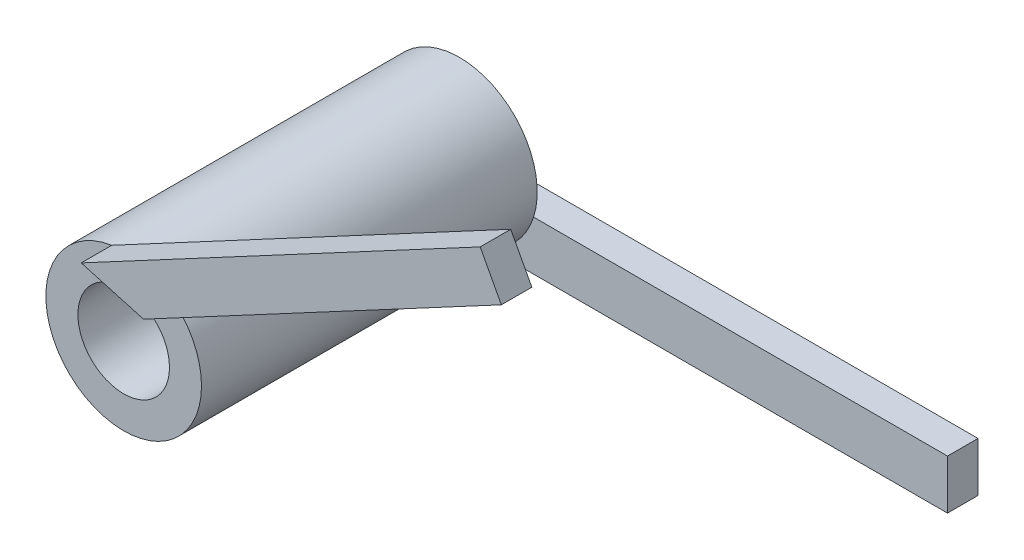
ISO-10303-21;
HEADER;
FILE_DESCRIPTION(('STEP AP214'),'2;1');
FILE_NAME('part.step','',(''),(''),'','','');
FILE_SCHEMA(('AUTOMOTIVE_DESIGN { 1 0 10303 214 1 1 1 1 }'));
ENDSEC;
DATA;
#1=APPLICATION_CONTEXT('core data for automotive mechanical design processes');
#2=APPLICATION_PROTOCOL_DEFINITION('international standard','automotive_design',2000,#1);
#3=PRODUCT_CONTEXT('',#1,'mechanical');
#4=PRODUCT('Part','Part','',(#3));
#5=PRODUCT_RELATED_PRODUCT_CATEGORY('part','',(#4));
#6=PRODUCT_DEFINITION_FORMATION('','',#4);
#7=PRODUCT_DEFINITION_CONTEXT('part definition',#1,'design');
#8=PRODUCT_DEFINITION('design','',#6,#7);
#9=PRODUCT_DEFINITION_SHAPE('','',#8);
#10=(LENGTH_UNIT() NAMED_UNIT(*) SI_UNIT(.MILLI.,.METRE.));
#11=(NAMED_UNIT(*) PLANE_ANGLE_UNIT() SI_UNIT($,.RADIAN.));
#12=(NAMED_UNIT(*) SI_UNIT($,.STERADIAN.) SOLID_ANGLE_UNIT());
#13=UNCERTAINTY_MEASURE_WITH_UNIT(LENGTH_MEASURE(1.E-05),#10,'distance_accuracy_value','');
#14=(GEOMETRIC_REPRESENTATION_CONTEXT(3) GLOBAL_UNCERTAINTY_ASSIGNED_CONTEXT((#13)) GLOBAL_UNIT_ASSIGNED_CONTEXT((#10,
#11,#12)) REPRESENTATION_CONTEXT('',''));
#15=CARTESIAN_POINT('',(0.,0.,0.));
#16=DIRECTION('',(0.,0.,1.));
#17=DIRECTION('',(1.,0.,0.));
#18=AXIS2_PLACEMENT_3D('',#15,#16,#17);
#19=CARTESIAN_POINT('',(0.,0.,0.));
#20=DIRECTION('',(0.,0.,1.));
#21=DIRECTION('',(1.,0.,0.));
#22=AXIS2_PLACEMENT_3D('',#19,#20,#21);
#23=PLANE('',#22);
#24=DIRECTION('',(1.,0.,0.));
#25=VECTOR('',#24,1.);
#26=CARTESIAN_POINT('',(15.9921185901509,-0.769222819599237,0.));
#27=LINE('',#26,#25);
#28=CARTESIAN_POINT('',(1.28774852118253,-0.769222819599236,0.));
#29=VERTEX_POINT('',#28);
#30=CARTESIAN_POINT('',(2.4312129182381,-0.769222819599236,0.));
#31=VERTEX_POINT('',#30);
#32=EDGE_CURVE('E140',#29,#31,#27,.T.);
#33=ORIENTED_EDGE('',*,*,#32,.F.);
#34=CARTESIAN_POINT('',(0.,0.,0.));
#35=DIRECTION('',(0.,0.,1.));
#36=DIRECTION('',(1.,0.,0.));
#37=AXIS2_PLACEMENT_3D('',#34,#35,#36);
#38=CIRCLE('',#37,1.5);
#39=CARTESIAN_POINT('',(0.892237221933101,-1.20578304010179,0.));
#40=VERTEX_POINT('',#39);
#41=EDGE_CURVE('E119',#29,#40,#38,.T.);
#42=ORIENTED_EDGE('',*,*,#41,.T.);
#43=DIRECTION('',(0.,1.,0.));
#44=VECTOR('',#43,1.);
#45=CARTESIAN_POINT('',(0.892237221933101,-0.769222819599236,0.));
#46=LINE('',#45,#44);
#47=CARTESIAN_POINT('',(0.892237221933099,-2.3888099003054,0.));
#48=VERTEX_POINT('',#47);
#49=EDGE_CURVE('E55',#48,#40,#46,.T.);
#50=ORIENTED_EDGE('',*,*,#49,.F.);
#51=CARTESIAN_POINT('',(0.,0.,0.));
#52=DIRECTION('',(0.,0.,1.));
#53=DIRECTION('',(1.,0.,0.));
#54=AXIS2_PLACEMENT_3D('',#51,#52,#53);
#55=CIRCLE('',#54,2.55);
#56=EDGE_CURVE('E180',#31,#48,#55,.T.);
#57=ORIENTED_EDGE('',*,*,#56,.F.);
#58=EDGE_LOOP('',(#33,#42,#50,#57));
#59=FACE_BOUND('',#58,.T.);
#60=ADVANCED_FACE('F31',(#59),#23,.F.);
#61=CARTESIAN_POINT('',(0.,0.,11.));
#62=DIRECTION('',(0.,0.,-1.));
#63=DIRECTION('',(-1.,0.,0.));
#64=AXIS2_PLACEMENT_3D('',#61,#62,#63);
#65=CYLINDRICAL_SURFACE('',#64,2.55);
#66=CARTESIAN_POINT('',(0.,0.,11.));
#67=DIRECTION('',(0.,0.,1.));
#68=DIRECTION('',(1.,0.,0.));
#69=AXIS2_PLACEMENT_3D('',#66,#67,#68);
#70=CIRCLE('',#69,2.55);
#71=CARTESIAN_POINT('',(1.6508899748961,1.94346656538968,11.));
#72=VERTEX_POINT('',#71);
#73=CARTESIAN_POINT('',(-0.39086642317314,2.51986575817757,11.));
#74=VERTEX_POINT('',#73);
#75=EDGE_CURVE('E11',#72,#74,#70,.T.);
#76=ORIENTED_EDGE('',*,*,#75,.F.);
#77=EDGE_CURVE('E40',#74,#72,#70,.T.);
#78=ORIENTED_EDGE('',*,*,#77,.F.);
#79=EDGE_LOOP('',(#76,#78));
#80=FACE_BOUND('',#79,.T.);
#81=EDGE_CURVE('E35',#48,#31,#55,.T.);
#82=ORIENTED_EDGE('',*,*,#81,.T.);
#83=ORIENTED_EDGE('',*,*,#56,.T.);
#84=EDGE_LOOP('',(#82,#83));
#85=FACE_BOUND('',#84,.T.);
#86=ADVANCED_FACE('F33',(#80,#85),#65,.T.);
#87=CARTESIAN_POINT('',(0.,0.,11.));
#88=DIRECTION('',(0.,0.,1.));
#89=DIRECTION('',(1.,0.,0.));
#90=AXIS2_PLACEMENT_3D('',#87,#88,#89);
#91=PLANE('',#90);
#92=CARTESIAN_POINT('',(0.,0.,11.));
#93=DIRECTION('',(0.,0.,1.));
#94=DIRECTION('',(1.,0.,0.));
#95=AXIS2_PLACEMENT_3D('',#92,#93,#94);
#96=CIRCLE('',#95,1.5);
#97=CARTESIAN_POINT('',(1.5,0.,11.));
#98=VERTEX_POINT('',#97);
#99=EDGE_CURVE('E112',#98,#98,#96,.T.);
#100=ORIENTED_EDGE('',*,*,#99,.F.);
#101=EDGE_LOOP('',(#100));
#102=FACE_BOUND('',#101,.T.);
#103=DIRECTION('',(0.962385712636492,-0.271686841994881,0.));
#104=VECTOR('',#103,1.);
#105=CARTESIAN_POINT('',(-0.390866423173138,2.51986575817757,11.));
#106=LINE('',#105,#104);
#107=EDGE_CURVE('E150',#74,#72,#106,.T.);
#108=ORIENTED_EDGE('',*,*,#107,.F.);
#109=ORIENTED_EDGE('',*,*,#77,.T.);
#110=EDGE_LOOP('',(#108,#109));
#111=FACE_BOUND('',#110,.T.);
#112=ADVANCED_FACE('F190',(#102,#111),#91,.T.);
#113=CARTESIAN_POINT('',(19.4075649927269,-3.06934160141865,11.));
#114=DIRECTION('',(0.,0.,1.));
#115=DIRECTION('',(1.,0.,0.));
#116=AXIS2_PLACEMENT_3D('',#113,#114,#115);
#117=PLANE('',#116);
#118=DIRECTION('',(0.881831500923346,0.471564633936089,0.));
#119=VECTOR('',#118,1.);
#120=CARTESIAN_POINT('',(1.6508899748961,1.94346656538968,11.));
#121=LINE('',#120,#119);
#122=CARTESIAN_POINT('',(13.3744273772456,8.21269783892247,11.));
#123=VERTEX_POINT('',#122);
#124=EDGE_CURVE('E164',#72,#123,#121,.T.);
#125=ORIENTED_EDGE('',*,*,#124,.F.);
#126=ORIENTED_EDGE('',*,*,#75,.T.);
#127=DIRECTION('',(-0.881831500923346,-0.47156463393609,0.));
#128=VECTOR('',#127,1.);
#129=CARTESIAN_POINT('',(12.6807053085322,9.50996639778581,11.));
#130=LINE('',#129,#128);
#131=CARTESIAN_POINT('',(12.6807053085322,9.50996639778581,11.));
#132=VERTEX_POINT('',#131);
#133=EDGE_CURVE('E155',#132,#74,#130,.T.);
#134=ORIENTED_EDGE('',*,*,#133,.F.);
#135=DIRECTION('',(-0.47156463393609,0.881831500923346,0.));
#136=VECTOR('',#135,1.);
#137=CARTESIAN_POINT('',(13.3744273772456,8.21269783892247,11.));
#138=LINE('',#137,#136);
#139=EDGE_CURVE('E166',#123,#132,#138,.T.);
#140=ORIENTED_EDGE('',*,*,#139,.F.);
#141=EDGE_LOOP('',(#125,#126,#134,#140));
#142=FACE_BOUND('',#141,.T.);
#143=ADVANCED_FACE('F194',(#142),#117,.F.);
#144=CARTESIAN_POINT('',(-0.390866423173138,2.51986575817757,12.));
#145=DIRECTION('',(0.271686841994881,0.962385712636492,0.));
#146=DIRECTION('',(-0.962385712636492,0.271686841994881,0.));
#147=AXIS2_PLACEMENT_3D('',#144,#145,#146);
#148=PLANE('',#147);
#149=ORIENTED_EDGE('',*,*,#107,.T.);
#150=DIRECTION('',(0.,0.,-1.));
#151=VECTOR('',#150,1.);
#152=CARTESIAN_POINT('',(1.6508899748961,1.94346656538968,12.));
#153=LINE('',#152,#151);
#154=CARTESIAN_POINT('',(1.6508899748961,1.94346656538968,12.));
#155=VERTEX_POINT('',#154);
#156=EDGE_CURVE('E178',#155,#72,#153,.T.);
#157=ORIENTED_EDGE('',*,*,#156,.F.);
#158=DIRECTION('',(0.962385712636492,-0.271686841994881,0.));
#159=VECTOR('',#158,1.);
#160=CARTESIAN_POINT('',(-0.390866423173138,2.51986575817757,12.));
#161=LINE('',#160,#159);
#162=CARTESIAN_POINT('',(-0.390866423173138,2.51986575817757,12.));
#163=VERTEX_POINT('',#162);
#164=EDGE_CURVE('E151',#163,#155,#161,.T.);
#165=ORIENTED_EDGE('',*,*,#164,.F.);
#166=DIRECTION('',(0.,0.,-1.));
#167=VECTOR('',#166,1.);
#168=CARTESIAN_POINT('',(-0.390866423173138,2.51986575817757,12.));
#169=LINE('',#168,#167);
#170=EDGE_CURVE('E161',#163,#74,#169,.T.);
#171=ORIENTED_EDGE('',*,*,#170,.T.);
#172=EDGE_LOOP('',(#149,#157,#165,#171));
#173=FACE_BOUND('',#172,.T.);
#174=ADVANCED_FACE('F208',(#173),#148,.F.);
#175=CARTESIAN_POINT('',(1.6508899748961,1.94346656538968,12.));
#176=DIRECTION('',(-0.471564633936089,0.881831500923346,0.));
#177=DIRECTION('',(-0.881831500923347,-0.47156463393609,0.));
#178=AXIS2_PLACEMENT_3D('',#175,#176,#177);
#179=PLANE('',#178);
#180=ORIENTED_EDGE('',*,*,#124,.T.);
#181=DIRECTION('',(0.,0.,-1.));
#182=VECTOR('',#181,1.);
#183=CARTESIAN_POINT('',(13.3744273772456,8.21269783892247,12.));
#184=LINE('',#183,#182);
#185=CARTESIAN_POINT('',(13.3744273772456,8.21269783892247,12.));
#186=VERTEX_POINT('',#185);
#187=EDGE_CURVE('E175',#186,#123,#184,.T.);
#188=ORIENTED_EDGE('',*,*,#187,.F.);
#189=DIRECTION('',(0.881831500923346,0.471564633936089,0.));
#190=VECTOR('',#189,1.);
#191=CARTESIAN_POINT('',(1.6508899748961,1.94346656538968,12.));
#192=LINE('',#191,#190);
#193=EDGE_CURVE('E154',#155,#186,#192,.T.);
#194=ORIENTED_EDGE('',*,*,#193,.F.);
#195=ORIENTED_EDGE('',*,*,#156,.T.);
#196=EDGE_LOOP('',(#180,#188,#194,#195));
#197=FACE_BOUND('',#196,.T.);
#198=ADVANCED_FACE('F197',(#197),#179,.F.);
#199=CARTESIAN_POINT('',(13.3744273772456,8.21269783892247,12.));
#200=DIRECTION('',(-0.881831500923346,-0.47156463393609,0.));
#201=DIRECTION('',(0.47156463393609,-0.881831500923346,0.));
#202=AXIS2_PLACEMENT_3D('',#199,#200,#201);
#203=PLANE('',#202);
#204=ORIENTED_EDGE('',*,*,#139,.T.);
#205=DIRECTION('',(0.,0.,-1.));
#206=VECTOR('',#205,1.);
#207=CARTESIAN_POINT('',(12.6807053085322,9.50996639778581,12.));
#208=LINE('',#207,#206);
#209=CARTESIAN_POINT('',(12.6807053085322,9.50996639778581,12.));
#210=VERTEX_POINT('',#209);
#211=EDGE_CURVE('E172',#210,#132,#208,.T.);
#212=ORIENTED_EDGE('',*,*,#211,.F.);
#213=DIRECTION('',(-0.47156463393609,0.881831500923346,0.));
#214=VECTOR('',#213,1.);
#215=CARTESIAN_POINT('',(13.3744273772456,8.21269783892247,12.));
#216=LINE('',#215,#214);
#217=EDGE_CURVE('E157',#186,#210,#216,.T.);
#218=ORIENTED_EDGE('',*,*,#217,.F.);
#219=ORIENTED_EDGE('',*,*,#187,.T.);
#220=EDGE_LOOP('',(#204,#212,#218,#219));
#221=FACE_BOUND('',#220,.T.);
#222=ADVANCED_FACE('F200',(#221),#203,.F.);
#223=CARTESIAN_POINT('',(12.6807053085322,9.50996639778581,12.));
#224=DIRECTION('',(0.47156463393609,-0.881831500923346,0.));
#225=DIRECTION('',(0.881831500923346,0.47156463393609,0.));
#226=AXIS2_PLACEMENT_3D('',#223,#224,#225);
#227=PLANE('',#226);
#228=ORIENTED_EDGE('',*,*,#133,.T.);
#229=ORIENTED_EDGE('',*,*,#170,.F.);
#230=DIRECTION('',(-0.881831500923346,-0.47156463393609,0.));
#231=VECTOR('',#230,1.);
#232=CARTESIAN_POINT('',(12.6807053085322,9.50996639778581,12.));
#233=LINE('',#232,#231);
#234=EDGE_CURVE('E159',#210,#163,#233,.T.);
#235=ORIENTED_EDGE('',*,*,#234,.F.);
#236=ORIENTED_EDGE('',*,*,#211,.T.);
#237=EDGE_LOOP('',(#228,#229,#235,#236));
#238=FACE_BOUND('',#237,.T.);
#239=ADVANCED_FACE('F210',(#238),#227,.F.);
#240=CARTESIAN_POINT('',(19.4075649927269,-3.06934160141865,12.));
#241=DIRECTION('',(0.,0.,1.));
#242=DIRECTION('',(1.,0.,0.));
#243=AXIS2_PLACEMENT_3D('',#240,#241,#242);
#244=PLANE('',#243);
#245=ORIENTED_EDGE('',*,*,#164,.T.);
#246=ORIENTED_EDGE('',*,*,#193,.T.);
#247=ORIENTED_EDGE('',*,*,#217,.T.);
#248=ORIENTED_EDGE('',*,*,#234,.T.);
#249=EDGE_LOOP('',(#245,#246,#247,#248));
#250=FACE_BOUND('',#249,.T.);
#251=ADVANCED_FACE('F204',(#250),#244,.T.);
#252=CARTESIAN_POINT('',(0.8922372219331,-2.3888099003054,0.));
#253=DIRECTION('',(0.,0.,1.));
#254=DIRECTION('',(1.,0.,0.));
#255=AXIS2_PLACEMENT_3D('',#252,#253,#254);
#256=PLANE('',#255);
#257=ORIENTED_EDGE('',*,*,#81,.F.);
#258=DIRECTION('',(-1.,0.,0.));
#259=VECTOR('',#258,1.);
#260=CARTESIAN_POINT('',(0.8922372219331,-2.3888099003054,0.));
#261=LINE('',#260,#259);
#262=CARTESIAN_POINT('',(15.9921185901509,-2.38880990030541,0.));
#263=VERTEX_POINT('',#262);
#264=EDGE_CURVE('E126',#263,#48,#261,.T.);
#265=ORIENTED_EDGE('',*,*,#264,.F.);
#266=DIRECTION('',(0.,-1.,0.));
#267=VECTOR('',#266,1.);
#268=CARTESIAN_POINT('',(15.9921185901509,-2.38880990030541,0.));
#269=LINE('',#268,#267);
#270=CARTESIAN_POINT('',(15.9921185901509,-0.769222819599237,0.));
#271=VERTEX_POINT('',#270);
#272=EDGE_CURVE('E131',#271,#263,#269,.T.);
#273=ORIENTED_EDGE('',*,*,#272,.F.);
#274=EDGE_CURVE('E139',#31,#271,#27,.T.);
#275=ORIENTED_EDGE('',*,*,#274,.F.);
#276=EDGE_LOOP('',(#257,#265,#273,#275));
#277=FACE_BOUND('',#276,.T.);
#278=ADVANCED_FACE('F217',(#277),#256,.T.);
#279=CARTESIAN_POINT('',(0.892237221933101,-0.769222819599236,-1.));
#280=DIRECTION('',(1.,0.,0.));
#281=DIRECTION('',(0.,1.,0.));
#282=AXIS2_PLACEMENT_3D('',#279,#280,#281);
#283=PLANE('',#282);
#284=ORIENTED_EDGE('',*,*,#49,.T.);
#285=DIRECTION('',(0.,0.,1.));
#286=VECTOR('',#285,1.);
#287=CARTESIAN_POINT('',(0.892237221933101,-1.20578304010179,-1.));
#288=LINE('',#287,#286);
#289=CARTESIAN_POINT('',(0.892237221933101,-1.20578304010178,-1.));
#290=VERTEX_POINT('',#289);
#291=EDGE_CURVE('E108',#40,#290,#288,.F.);
#292=ORIENTED_EDGE('',*,*,#291,.T.);
#293=DIRECTION('',(0.,1.,0.));
#294=VECTOR('',#293,1.);
#295=CARTESIAN_POINT('',(0.892237221933101,-0.769222819599236,-1.));
#296=LINE('',#295,#294);
#297=CARTESIAN_POINT('',(0.8922372219331,-2.3888099003054,-1.));
#298=VERTEX_POINT('',#297);
#299=EDGE_CURVE('E118',#298,#290,#296,.T.);
#300=ORIENTED_EDGE('',*,*,#299,.F.);
#301=DIRECTION('',(0.,0.,1.));
#302=VECTOR('',#301,1.);
#303=CARTESIAN_POINT('',(0.8922372219331,-2.3888099003054,-1.));
#304=LINE('',#303,#302);
#305=EDGE_CURVE('E137',#298,#48,#304,.T.);
#306=ORIENTED_EDGE('',*,*,#305,.T.);
#307=EDGE_LOOP('',(#284,#292,#300,#306));
#308=FACE_BOUND('',#307,.T.);
#309=ADVANCED_FACE('F116',(#308),#283,.F.);
#310=CARTESIAN_POINT('',(15.9921185901509,-0.769222819599237,-1.));
#311=DIRECTION('',(0.,-1.,0.));
#312=DIRECTION('',(1.,0.,0.));
#313=AXIS2_PLACEMENT_3D('',#310,#311,#312);
#314=PLANE('',#313);
#315=DIRECTION('',(1.,0.,0.));
#316=VECTOR('',#315,1.);
#317=CARTESIAN_POINT('',(15.9921185901509,-0.769222819599237,-1.));
#318=LINE('',#317,#316);
#319=CARTESIAN_POINT('',(1.28774852118253,-0.769222819599236,-1.));
#320=VERTEX_POINT('',#319);
#321=CARTESIAN_POINT('',(15.9921185901509,-0.769222819599237,-1.));
#322=VERTEX_POINT('',#321);
#323=EDGE_CURVE('E125',#320,#322,#318,.T.);
#324=ORIENTED_EDGE('',*,*,#323,.F.);
#325=DIRECTION('',(0.,0.,1.));
#326=VECTOR('',#325,1.);
#327=CARTESIAN_POINT('',(1.28774852118253,-0.769222819599236,-1.));
#328=LINE('',#327,#326);
#329=EDGE_CURVE('E47',#320,#29,#328,.T.);
#330=ORIENTED_EDGE('',*,*,#329,.T.);
#331=ORIENTED_EDGE('',*,*,#32,.T.);
#332=ORIENTED_EDGE('',*,*,#274,.T.);
#333=DIRECTION('',(0.,0.,1.));
#334=VECTOR('',#333,1.);
#335=CARTESIAN_POINT('',(15.9921185901509,-0.769222819599237,-1.));
#336=LINE('',#335,#334);
#337=EDGE_CURVE('E147',#322,#271,#336,.T.);
#338=ORIENTED_EDGE('',*,*,#337,.F.);
#339=EDGE_LOOP('',(#324,#330,#331,#332,#338));
#340=FACE_BOUND('',#339,.T.);
#341=ADVANCED_FACE('F282',(#340),#314,.F.);
#342=CARTESIAN_POINT('',(15.9921185901509,-2.38880990030541,-1.));
#343=DIRECTION('',(-1.,0.,0.));
#344=DIRECTION('',(0.,0.,1.));
#345=AXIS2_PLACEMENT_3D('',#342,#343,#344);
#346=PLANE('',#345);
#347=ORIENTED_EDGE('',*,*,#272,.T.);
#348=DIRECTION('',(0.,0.,1.));
#349=VECTOR('',#348,1.);
#350=CARTESIAN_POINT('',(15.9921185901509,-2.38880990030541,-1.));
#351=LINE('',#350,#349);
#352=CARTESIAN_POINT('',(15.9921185901509,-2.38880990030541,-1.));
#353=VERTEX_POINT('',#352);
#354=EDGE_CURVE('E144',#353,#263,#351,.T.);
#355=ORIENTED_EDGE('',*,*,#354,.F.);
#356=DIRECTION('',(0.,-1.,0.));
#357=VECTOR('',#356,1.);
#358=CARTESIAN_POINT('',(15.9921185901509,-2.38880990030541,-1.));
#359=LINE('',#358,#357);
#360=EDGE_CURVE('E128',#322,#353,#359,.T.);
#361=ORIENTED_EDGE('',*,*,#360,.F.);
#362=ORIENTED_EDGE('',*,*,#337,.T.);
#363=EDGE_LOOP('',(#347,#355,#361,#362));
#364=FACE_BOUND('',#363,.T.);
#365=ADVANCED_FACE('F276',(#364),#346,.F.);
#366=CARTESIAN_POINT('',(0.8922372219331,-2.3888099003054,-1.));
#367=DIRECTION('',(0.,1.,0.));
#368=DIRECTION('',(-1.,0.,0.));
#369=AXIS2_PLACEMENT_3D('',#366,#367,#368);
#370=PLANE('',#369);
#371=ORIENTED_EDGE('',*,*,#264,.T.);
#372=ORIENTED_EDGE('',*,*,#305,.F.);
#373=DIRECTION('',(-1.,0.,0.));
#374=VECTOR('',#373,1.);
#375=CARTESIAN_POINT('',(0.8922372219331,-2.3888099003054,-1.));
#376=LINE('',#375,#374);
#377=EDGE_CURVE('E123',#353,#298,#376,.T.);
#378=ORIENTED_EDGE('',*,*,#377,.F.);
#379=ORIENTED_EDGE('',*,*,#354,.T.);
#380=EDGE_LOOP('',(#371,#372,#378,#379));
#381=FACE_BOUND('',#380,.T.);
#382=ADVANCED_FACE('F281',(#381),#370,.F.);
#383=CARTESIAN_POINT('',(0.8922372219331,-2.3888099003054,-1.));
#384=DIRECTION('',(0.,0.,1.));
#385=DIRECTION('',(1.,0.,0.));
#386=AXIS2_PLACEMENT_3D('',#383,#384,#385);
#387=PLANE('',#386);
#388=ORIENTED_EDGE('',*,*,#299,.T.);
#389=CARTESIAN_POINT('',(0.,0.,-1.));
#390=DIRECTION('',(0.,0.,1.));
#391=DIRECTION('',(1.,0.,0.));
#392=AXIS2_PLACEMENT_3D('',#389,#390,#391);
#393=CIRCLE('',#392,1.5);
#394=EDGE_CURVE('E105',#290,#320,#393,.T.);
#395=ORIENTED_EDGE('',*,*,#394,.T.);
#396=ORIENTED_EDGE('',*,*,#323,.T.);
#397=ORIENTED_EDGE('',*,*,#360,.T.);
#398=ORIENTED_EDGE('',*,*,#377,.T.);
#399=EDGE_LOOP('',(#388,#395,#396,#397,#398));
#400=FACE_BOUND('',#399,.T.);
#401=ADVANCED_FACE('F121',(#400),#387,.F.);
#402=CARTESIAN_POINT('',(0.,0.,-1.));
#403=DIRECTION('',(0.,0.,1.));
#404=DIRECTION('',(1.,0.,0.));
#405=AXIS2_PLACEMENT_3D('',#402,#403,#404);
#406=CYLINDRICAL_SURFACE('',#405,1.5);
#407=ORIENTED_EDGE('',*,*,#99,.T.);
#408=EDGE_LOOP('',(#407));
#409=FACE_BOUND('',#408,.T.);
#410=ORIENTED_EDGE('',*,*,#41,.F.);
#411=ORIENTED_EDGE('',*,*,#329,.F.);
#412=ORIENTED_EDGE('',*,*,#394,.F.);
#413=ORIENTED_EDGE('',*,*,#291,.F.);
#414=EDGE_LOOP('',(#410,#411,#412,#413));
#415=FACE_BOUND('',#414,.T.);
#416=ADVANCED_FACE('F107',(#409,#415),#406,.F.);
#417=CLOSED_SHELL('',(#60,#86,#112,#143,#174,#198,#222,#239,#251,#278,#309,#341,#365,#382,#401,#416));
#418=MANIFOLD_SOLID_BREP('B2',#417);
#419=ADVANCED_BREP_SHAPE_REPRESENTATION('',(#18,#418),#14);
#420=SHAPE_DEFINITION_REPRESENTATION(#9,#419);
ENDSEC;
END-ISO-10303-21;
